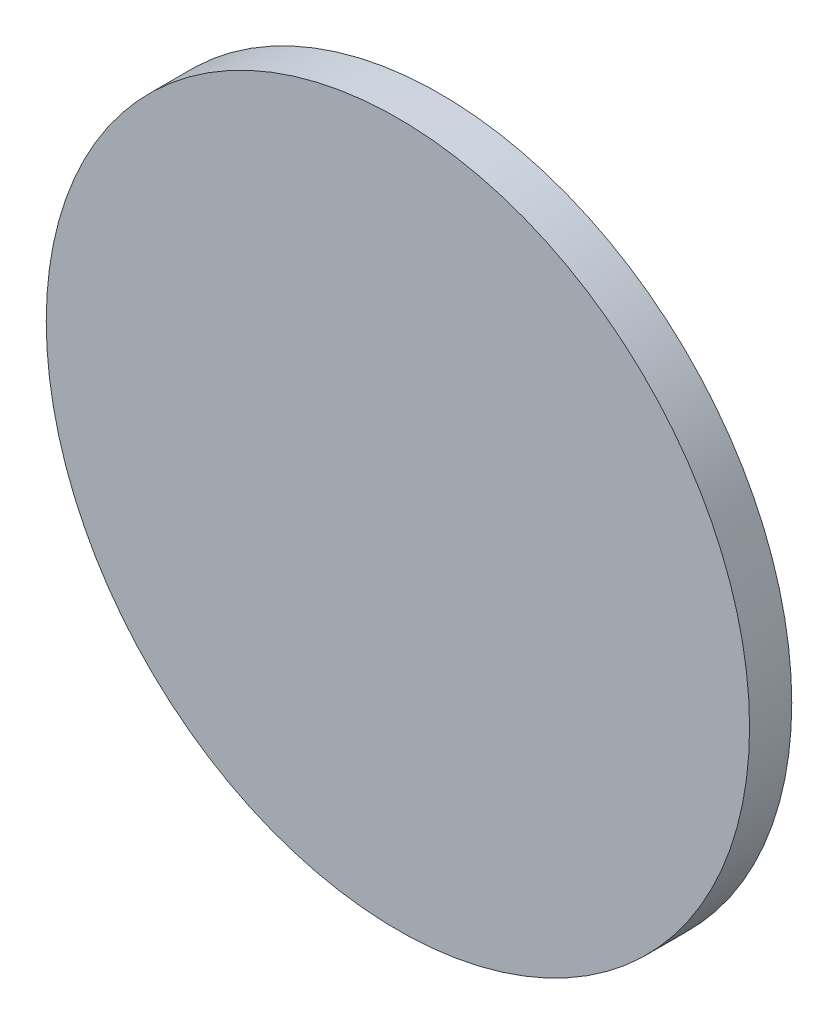
ISO-10303-21;
HEADER;
FILE_DESCRIPTION(('STEP AP214'),'2;1');
FILE_NAME('part.step','',(''),(''),'','','');
FILE_SCHEMA(('AUTOMOTIVE_DESIGN { 1 0 10303 214 1 1 1 1 }'));
ENDSEC;
DATA;
#1=APPLICATION_CONTEXT('core data for automotive mechanical design processes');
#2=APPLICATION_PROTOCOL_DEFINITION('international standard','automotive_design',2000,#1);
#3=PRODUCT_CONTEXT('',#1,'mechanical');
#4=PRODUCT('Part','Part','',(#3));
#5=PRODUCT_RELATED_PRODUCT_CATEGORY('part','',(#4));
#6=PRODUCT_DEFINITION_FORMATION('','',#4);
#7=PRODUCT_DEFINITION_CONTEXT('part definition',#1,'design');
#8=PRODUCT_DEFINITION('design','',#6,#7);
#9=PRODUCT_DEFINITION_SHAPE('','',#8);
#10=(LENGTH_UNIT() NAMED_UNIT(*) SI_UNIT(.MILLI.,.METRE.));
#11=(NAMED_UNIT(*) PLANE_ANGLE_UNIT() SI_UNIT($,.RADIAN.));
#12=(NAMED_UNIT(*) SI_UNIT($,.STERADIAN.) SOLID_ANGLE_UNIT());
#13=UNCERTAINTY_MEASURE_WITH_UNIT(LENGTH_MEASURE(1.E-05),#10,'distance_accuracy_value','');
#14=(GEOMETRIC_REPRESENTATION_CONTEXT(3) GLOBAL_UNCERTAINTY_ASSIGNED_CONTEXT((#13)) GLOBAL_UNIT_ASSIGNED_CONTEXT((#10,
#11,#12)) REPRESENTATION_CONTEXT('',''));
#15=CARTESIAN_POINT('',(0.,0.,0.));
#16=DIRECTION('',(0.,0.,1.));
#17=DIRECTION('',(1.,0.,0.));
#18=AXIS2_PLACEMENT_3D('',#15,#16,#17);
#19=CARTESIAN_POINT('',(0.,0.,3.));
#20=DIRECTION('',(0.,0.,-1.));
#21=DIRECTION('',(-1.,0.,0.));
#22=AXIS2_PLACEMENT_3D('',#19,#20,#21);
#23=CYLINDRICAL_SURFACE('',#22,25.);
#24=CARTESIAN_POINT('',(0.,0.,3.));
#25=DIRECTION('',(0.,0.,1.));
#26=DIRECTION('',(1.,0.,0.));
#27=AXIS2_PLACEMENT_3D('',#24,#25,#26);
#28=CIRCLE('',#27,25.);
#29=CARTESIAN_POINT('',(25.,0.,3.));
#30=VERTEX_POINT('',#29);
#31=EDGE_CURVE('E10',#30,#30,#28,.T.);
#32=ORIENTED_EDGE('',*,*,#31,.F.);
#33=EDGE_LOOP('',(#32));
#34=FACE_BOUND('',#33,.T.);
#35=CARTESIAN_POINT('',(0.,0.,0.));
#36=DIRECTION('',(0.,0.,1.));
#37=DIRECTION('',(1.,0.,0.));
#38=AXIS2_PLACEMENT_3D('',#35,#36,#37);
#39=CIRCLE('',#38,25.);
#40=CARTESIAN_POINT('',(25.,0.,0.));
#41=VERTEX_POINT('',#40);
#42=EDGE_CURVE('E38',#41,#41,#39,.T.);
#43=ORIENTED_EDGE('',*,*,#42,.T.);
#44=EDGE_LOOP('',(#43));
#45=FACE_BOUND('',#44,.T.);
#46=ADVANCED_FACE('F35',(#34,#45),#23,.T.);
#47=CARTESIAN_POINT('',(0.,0.,3.));
#48=DIRECTION('',(0.,0.,1.));
#49=DIRECTION('',(1.,0.,0.));
#50=AXIS2_PLACEMENT_3D('',#47,#48,#49);
#51=PLANE('',#50);
#52=ORIENTED_EDGE('',*,*,#31,.T.);
#53=EDGE_LOOP('',(#52));
#54=FACE_BOUND('',#53,.T.);
#55=ADVANCED_FACE('F50',(#54),#51,.T.);
#56=CARTESIAN_POINT('',(0.,0.,0.));
#57=DIRECTION('',(0.,0.,1.));
#58=DIRECTION('',(1.,0.,0.));
#59=AXIS2_PLACEMENT_3D('',#56,#57,#58);
#60=PLANE('',#59);
#61=ORIENTED_EDGE('',*,*,#42,.F.);
#62=EDGE_LOOP('',(#61));
#63=FACE_BOUND('',#62,.T.);
#64=ADVANCED_FACE('F48',(#63),#60,.F.);
#65=CLOSED_SHELL('',(#46,#55,#64));
#66=MANIFOLD_SOLID_BREP('B2',#65);
#67=ADVANCED_BREP_SHAPE_REPRESENTATION('',(#18,#66),#14);
#68=SHAPE_DEFINITION_REPRESENTATION(#9,#67);
ENDSEC;
END-ISO-10303-21;
